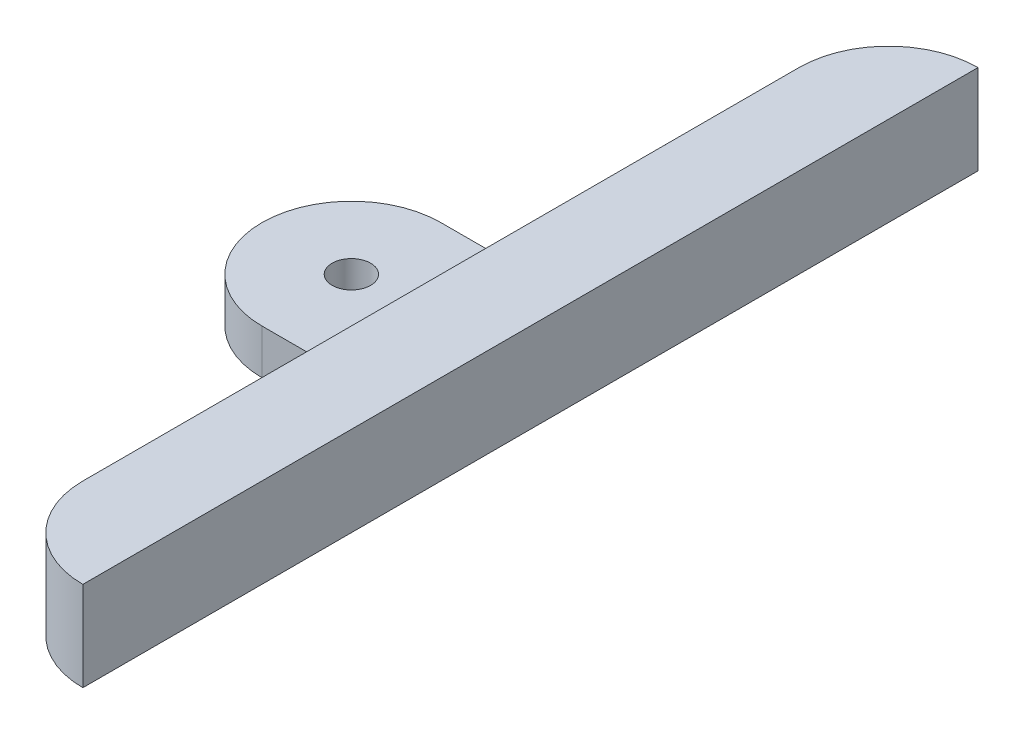
ISO-10303-21;
HEADER;
FILE_DESCRIPTION(('STEP AP214'),'2;1');
FILE_NAME('part.step','',(''),(''),'','','');
FILE_SCHEMA(('AUTOMOTIVE_DESIGN { 1 0 10303 214 1 1 1 1 }'));
ENDSEC;
DATA;
#1=APPLICATION_CONTEXT('core data for automotive mechanical design processes');
#2=APPLICATION_PROTOCOL_DEFINITION('international standard','automotive_design',2000,#1);
#3=PRODUCT_CONTEXT('',#1,'mechanical');
#4=PRODUCT('Part','Part','',(#3));
#5=PRODUCT_RELATED_PRODUCT_CATEGORY('part','',(#4));
#6=PRODUCT_DEFINITION_FORMATION('','',#4);
#7=PRODUCT_DEFINITION_CONTEXT('part definition',#1,'design');
#8=PRODUCT_DEFINITION('design','',#6,#7);
#9=PRODUCT_DEFINITION_SHAPE('','',#8);
#10=(LENGTH_UNIT() NAMED_UNIT(*) SI_UNIT(.MILLI.,.METRE.));
#11=(NAMED_UNIT(*) PLANE_ANGLE_UNIT() SI_UNIT($,.RADIAN.));
#12=(NAMED_UNIT(*) SI_UNIT($,.STERADIAN.) SOLID_ANGLE_UNIT());
#13=UNCERTAINTY_MEASURE_WITH_UNIT(LENGTH_MEASURE(1.E-05),#10,'distance_accuracy_value','');
#14=(GEOMETRIC_REPRESENTATION_CONTEXT(3) GLOBAL_UNCERTAINTY_ASSIGNED_CONTEXT((#13)) GLOBAL_UNIT_ASSIGNED_CONTEXT((#10,
#11,#12)) REPRESENTATION_CONTEXT('',''));
#15=CARTESIAN_POINT('',(0.,0.,0.));
#16=DIRECTION('',(0.,0.,1.));
#17=DIRECTION('',(1.,0.,0.));
#18=AXIS2_PLACEMENT_3D('',#15,#16,#17);
#19=CARTESIAN_POINT('',(-10.,5.,-50.));
#20=DIRECTION('',(1.,0.,0.));
#21=DIRECTION('',(0.,0.,-1.));
#22=AXIS2_PLACEMENT_3D('',#19,#20,#21);
#23=PLANE('',#22);
#24=DIRECTION('',(0.,0.,1.));
#25=VECTOR('',#24,1.);
#26=CARTESIAN_POINT('',(-10.,10.,-50.));
#27=LINE('',#26,#25);
#28=CARTESIAN_POINT('',(-10.,10.,-40.));
#29=VERTEX_POINT('',#28);
#30=CARTESIAN_POINT('',(-10.,10.,40.));
#31=VERTEX_POINT('',#30);
#32=EDGE_CURVE('E145',#29,#31,#27,.T.);
#33=ORIENTED_EDGE('',*,*,#32,.F.);
#34=DIRECTION('',(0.,-1.,0.));
#35=VECTOR('',#34,1.);
#36=CARTESIAN_POINT('',(-10.,5.,-40.));
#37=LINE('',#36,#35);
#38=CARTESIAN_POINT('',(-10.,0.,-40.));
#39=VERTEX_POINT('',#38);
#40=EDGE_CURVE('E176',#29,#39,#37,.T.);
#41=ORIENTED_EDGE('',*,*,#40,.T.);
#42=DIRECTION('',(0.,0.,1.));
#43=VECTOR('',#42,1.);
#44=CARTESIAN_POINT('',(-10.,0.,-50.));
#45=LINE('',#44,#43);
#46=CARTESIAN_POINT('',(-9.99999999999999,0.,-10.));
#47=VERTEX_POINT('',#46);
#48=EDGE_CURVE('E130',#39,#47,#45,.T.);
#49=ORIENTED_EDGE('',*,*,#48,.T.);
#50=DIRECTION('',(0.,-1.,0.));
#51=VECTOR('',#50,1.);
#52=CARTESIAN_POINT('',(-9.99999999999999,0.,-10.));
#53=LINE('',#52,#51);
#54=CARTESIAN_POINT('',(-9.99999999999999,5.,-10.));
#55=VERTEX_POINT('',#54);
#56=EDGE_CURVE('E116',#55,#47,#53,.T.);
#57=ORIENTED_EDGE('',*,*,#56,.F.);
#58=DIRECTION('',(0.,0.,-1.));
#59=VECTOR('',#58,1.);
#60=CARTESIAN_POINT('',(-9.99999999999999,5.,-10.));
#61=LINE('',#60,#59);
#62=CARTESIAN_POINT('',(-9.99999999999999,5.,10.));
#63=VERTEX_POINT('',#62);
#64=EDGE_CURVE('E127',#63,#55,#61,.T.);
#65=ORIENTED_EDGE('',*,*,#64,.F.);
#66=DIRECTION('',(0.,1.,0.));
#67=VECTOR('',#66,1.);
#68=CARTESIAN_POINT('',(-9.99999999999999,5.,10.));
#69=LINE('',#68,#67);
#70=CARTESIAN_POINT('',(-9.99999999999998,0.,10.));
#71=VERTEX_POINT('',#70);
#72=EDGE_CURVE('E136',#71,#63,#69,.T.);
#73=ORIENTED_EDGE('',*,*,#72,.F.);
#74=CARTESIAN_POINT('',(-9.99999999999998,0.,40.));
#75=VERTEX_POINT('',#74);
#76=EDGE_CURVE('E150',#71,#75,#45,.T.);
#77=ORIENTED_EDGE('',*,*,#76,.T.);
#78=DIRECTION('',(0.,-1.,0.));
#79=VECTOR('',#78,1.);
#80=CARTESIAN_POINT('',(-9.99999999999998,5.,40.));
#81=LINE('',#80,#79);
#82=EDGE_CURVE('E62',#75,#31,#81,.F.);
#83=ORIENTED_EDGE('',*,*,#82,.T.);
#84=EDGE_LOOP('',(#33,#41,#49,#57,#65,#73,#77,#83));
#85=FACE_BOUND('',#84,.T.);
#86=ADVANCED_FACE('F39',(#85),#23,.F.);
#87=CARTESIAN_POINT('',(0.,5.,-50.));
#88=DIRECTION('',(-1.,0.,0.));
#89=DIRECTION('',(0.,0.,1.));
#90=AXIS2_PLACEMENT_3D('',#87,#88,#89);
#91=PLANE('',#90);
#92=DIRECTION('',(0.,0.,-1.));
#93=VECTOR('',#92,1.);
#94=CARTESIAN_POINT('',(0.,0.,-50.));
#95=LINE('',#94,#93);
#96=CARTESIAN_POINT('',(0.,0.,50.));
#97=VERTEX_POINT('',#96);
#98=CARTESIAN_POINT('',(0.,0.,-50.));
#99=VERTEX_POINT('',#98);
#100=EDGE_CURVE('E152',#97,#99,#95,.T.);
#101=ORIENTED_EDGE('',*,*,#100,.T.);
#102=DIRECTION('',(0.,-1.,0.));
#103=VECTOR('',#102,1.);
#104=CARTESIAN_POINT('',(0.,5.,-50.));
#105=LINE('',#104,#103);
#106=CARTESIAN_POINT('',(0.,10.,-50.));
#107=VERTEX_POINT('',#106);
#108=EDGE_CURVE('E155',#107,#99,#105,.T.);
#109=ORIENTED_EDGE('',*,*,#108,.F.);
#110=DIRECTION('',(0.,0.,-1.));
#111=VECTOR('',#110,1.);
#112=CARTESIAN_POINT('',(0.,10.,-50.));
#113=LINE('',#112,#111);
#114=CARTESIAN_POINT('',(0.,10.,50.));
#115=VERTEX_POINT('',#114);
#116=EDGE_CURVE('E147',#115,#107,#113,.T.);
#117=ORIENTED_EDGE('',*,*,#116,.F.);
#118=DIRECTION('',(0.,-1.,0.));
#119=VECTOR('',#118,1.);
#120=CARTESIAN_POINT('',(0.,5.,50.));
#121=LINE('',#120,#119);
#122=EDGE_CURVE('E157',#115,#97,#121,.T.);
#123=ORIENTED_EDGE('',*,*,#122,.T.);
#124=EDGE_LOOP('',(#101,#109,#117,#123));
#125=FACE_BOUND('',#124,.T.);
#126=ADVANCED_FACE('F188',(#125),#91,.F.);
#127=CARTESIAN_POINT('',(0.,0.,0.));
#128=DIRECTION('',(0.,1.,0.));
#129=DIRECTION('',(0.,0.,1.));
#130=AXIS2_PLACEMENT_3D('',#127,#128,#129);
#131=PLANE('',#130);
#132=CARTESIAN_POINT('',(-20.,0.,0.));
#133=DIRECTION('',(0.,1.,0.));
#134=DIRECTION('',(0.,0.,1.));
#135=AXIS2_PLACEMENT_3D('',#132,#133,#134);
#136=CIRCLE('',#135,2.15);
#137=CARTESIAN_POINT('',(-20.,0.,2.14999999999999));
#138=VERTEX_POINT('',#137);
#139=EDGE_CURVE('E174',#138,#138,#136,.F.);
#140=ORIENTED_EDGE('',*,*,#139,.F.);
#141=EDGE_LOOP('',(#140));
#142=FACE_BOUND('',#141,.T.);
#143=ORIENTED_EDGE('',*,*,#48,.F.);
#144=CARTESIAN_POINT('',(0.,0.,-40.));
#145=DIRECTION('',(0.,1.,0.));
#146=DIRECTION('',(0.,0.,1.));
#147=AXIS2_PLACEMENT_3D('',#144,#145,#146);
#148=CIRCLE('',#147,10.);
#149=EDGE_CURVE('E54',#39,#99,#148,.F.);
#150=ORIENTED_EDGE('',*,*,#149,.T.);
#151=ORIENTED_EDGE('',*,*,#100,.F.);
#152=CARTESIAN_POINT('',(0.,0.,40.));
#153=DIRECTION('',(0.,1.,0.));
#154=DIRECTION('',(0.,0.,1.));
#155=AXIS2_PLACEMENT_3D('',#152,#153,#154);
#156=CIRCLE('',#155,10.);
#157=EDGE_CURVE('E178',#97,#75,#156,.F.);
#158=ORIENTED_EDGE('',*,*,#157,.T.);
#159=ORIENTED_EDGE('',*,*,#76,.F.);
#160=DIRECTION('',(1.,0.,0.));
#161=VECTOR('',#160,1.);
#162=CARTESIAN_POINT('',(-30.,0.,10.));
#163=LINE('',#162,#161);
#164=CARTESIAN_POINT('',(-20.,0.,10.));
#165=VERTEX_POINT('',#164);
#166=EDGE_CURVE('E132',#165,#71,#163,.T.);
#167=ORIENTED_EDGE('',*,*,#166,.F.);
#168=CARTESIAN_POINT('',(-20.,0.,0.));
#169=DIRECTION('',(0.,1.,0.));
#170=DIRECTION('',(0.,0.,1.));
#171=AXIS2_PLACEMENT_3D('',#168,#169,#170);
#172=CIRCLE('',#171,10.);
#173=CARTESIAN_POINT('',(-30.,0.,0.));
#174=VERTEX_POINT('',#173);
#175=EDGE_CURVE('E169',#165,#174,#172,.F.);
#176=ORIENTED_EDGE('',*,*,#175,.T.);
#177=CARTESIAN_POINT('',(-20.,0.,0.));
#178=DIRECTION('',(0.,1.,0.));
#179=DIRECTION('',(0.,0.,1.));
#180=AXIS2_PLACEMENT_3D('',#177,#178,#179);
#181=CIRCLE('',#180,10.);
#182=CARTESIAN_POINT('',(-20.,0.,-10.));
#183=VERTEX_POINT('',#182);
#184=EDGE_CURVE('E167',#174,#183,#181,.F.);
#185=ORIENTED_EDGE('',*,*,#184,.T.);
#186=DIRECTION('',(1.,0.,0.));
#187=VECTOR('',#186,1.);
#188=CARTESIAN_POINT('',(-30.,0.,-9.99999999999999));
#189=LINE('',#188,#187);
#190=EDGE_CURVE('E123',#183,#47,#189,.T.);
#191=ORIENTED_EDGE('',*,*,#190,.T.);
#192=EDGE_LOOP('',(#143,#150,#151,#158,#159,#167,#176,#185,#191));
#193=FACE_BOUND('',#192,.T.);
#194=ADVANCED_FACE('F192',(#142,#193),#131,.F.);
#195=CARTESIAN_POINT('',(0.,10.,0.));
#196=DIRECTION('',(0.,1.,0.));
#197=DIRECTION('',(0.,0.,1.));
#198=AXIS2_PLACEMENT_3D('',#195,#196,#197);
#199=PLANE('',#198);
#200=ORIENTED_EDGE('',*,*,#116,.T.);
#201=CARTESIAN_POINT('',(0.,10.,-40.));
#202=DIRECTION('',(0.,1.,0.));
#203=DIRECTION('',(0.,0.,1.));
#204=AXIS2_PLACEMENT_3D('',#201,#202,#203);
#205=CIRCLE('',#204,10.);
#206=EDGE_CURVE('E11',#107,#29,#205,.T.);
#207=ORIENTED_EDGE('',*,*,#206,.T.);
#208=ORIENTED_EDGE('',*,*,#32,.T.);
#209=CARTESIAN_POINT('',(0.,10.,40.));
#210=DIRECTION('',(0.,1.,0.));
#211=DIRECTION('',(0.,0.,1.));
#212=AXIS2_PLACEMENT_3D('',#209,#210,#211);
#213=CIRCLE('',#212,10.);
#214=EDGE_CURVE('E47',#31,#115,#213,.T.);
#215=ORIENTED_EDGE('',*,*,#214,.T.);
#216=EDGE_LOOP('',(#200,#207,#208,#215));
#217=FACE_BOUND('',#216,.T.);
#218=ADVANCED_FACE('F183',(#217),#199,.T.);
#219=CARTESIAN_POINT('',(-30.,5.,10.));
#220=DIRECTION('',(0.,0.,-1.));
#221=DIRECTION('',(0.,1.,0.));
#222=AXIS2_PLACEMENT_3D('',#219,#220,#221);
#223=PLANE('',#222);
#224=DIRECTION('',(1.,0.,0.));
#225=VECTOR('',#224,1.);
#226=CARTESIAN_POINT('',(-30.,5.,10.));
#227=LINE('',#226,#225);
#228=CARTESIAN_POINT('',(-20.,5.,10.));
#229=VERTEX_POINT('',#228);
#230=EDGE_CURVE('E122',#229,#63,#227,.T.);
#231=ORIENTED_EDGE('',*,*,#230,.F.);
#232=DIRECTION('',(0.,1.,0.));
#233=VECTOR('',#232,1.);
#234=CARTESIAN_POINT('',(-20.,5.,10.));
#235=LINE('',#234,#233);
#236=EDGE_CURVE('E164',#229,#165,#235,.F.);
#237=ORIENTED_EDGE('',*,*,#236,.T.);
#238=ORIENTED_EDGE('',*,*,#166,.T.);
#239=ORIENTED_EDGE('',*,*,#72,.T.);
#240=EDGE_LOOP('',(#231,#237,#238,#239));
#241=FACE_BOUND('',#240,.T.);
#242=ADVANCED_FACE('F195',(#241),#223,.F.);
#243=CARTESIAN_POINT('',(-30.,5.,-10.));
#244=DIRECTION('',(0.,-1.,0.));
#245=DIRECTION('',(0.,0.,-1.));
#246=AXIS2_PLACEMENT_3D('',#243,#244,#245);
#247=PLANE('',#246);
#248=CARTESIAN_POINT('',(-20.,5.,0.));
#249=DIRECTION('',(0.,1.,0.));
#250=DIRECTION('',(0.,0.,1.));
#251=AXIS2_PLACEMENT_3D('',#248,#249,#250);
#252=CIRCLE('',#251,2.15);
#253=CARTESIAN_POINT('',(-20.,5.,2.14999999999999));
#254=VERTEX_POINT('',#253);
#255=EDGE_CURVE('E362',#254,#254,#252,.T.);
#256=ORIENTED_EDGE('',*,*,#255,.F.);
#257=EDGE_LOOP('',(#256));
#258=FACE_BOUND('',#257,.T.);
#259=CARTESIAN_POINT('',(-20.,5.,0.));
#260=DIRECTION('',(0.,-1.,0.));
#261=DIRECTION('',(0.,0.,-1.));
#262=AXIS2_PLACEMENT_3D('',#259,#260,#261);
#263=CIRCLE('',#262,10.);
#264=CARTESIAN_POINT('',(-20.,5.,-10.));
#265=VERTEX_POINT('',#264);
#266=CARTESIAN_POINT('',(-30.,5.,0.));
#267=VERTEX_POINT('',#266);
#268=EDGE_CURVE('E160',#265,#267,#263,.F.);
#269=ORIENTED_EDGE('',*,*,#268,.T.);
#270=CARTESIAN_POINT('',(-20.,5.,0.));
#271=DIRECTION('',(0.,-1.,0.));
#272=DIRECTION('',(0.,0.,-1.));
#273=AXIS2_PLACEMENT_3D('',#270,#271,#272);
#274=CIRCLE('',#273,10.);
#275=EDGE_CURVE('E162',#267,#229,#274,.F.);
#276=ORIENTED_EDGE('',*,*,#275,.T.);
#277=ORIENTED_EDGE('',*,*,#230,.T.);
#278=ORIENTED_EDGE('',*,*,#64,.T.);
#279=DIRECTION('',(1.,0.,0.));
#280=VECTOR('',#279,1.);
#281=CARTESIAN_POINT('',(-30.,5.,-10.));
#282=LINE('',#281,#280);
#283=EDGE_CURVE('E112',#265,#55,#282,.T.);
#284=ORIENTED_EDGE('',*,*,#283,.F.);
#285=EDGE_LOOP('',(#269,#276,#277,#278,#284));
#286=FACE_BOUND('',#285,.T.);
#287=ADVANCED_FACE('F134',(#258,#286),#247,.F.);
#288=CARTESIAN_POINT('',(-30.,0.,-9.99999999999999));
#289=DIRECTION('',(0.,0.,1.));
#290=DIRECTION('',(0.,-1.,0.));
#291=AXIS2_PLACEMENT_3D('',#288,#289,#290);
#292=PLANE('',#291);
#293=ORIENTED_EDGE('',*,*,#190,.F.);
#294=DIRECTION('',(0.,-1.,0.));
#295=VECTOR('',#294,1.);
#296=CARTESIAN_POINT('',(-20.,0.,-10.));
#297=LINE('',#296,#295);
#298=EDGE_CURVE('E118',#183,#265,#297,.F.);
#299=ORIENTED_EDGE('',*,*,#298,.T.);
#300=ORIENTED_EDGE('',*,*,#283,.T.);
#301=ORIENTED_EDGE('',*,*,#56,.T.);
#302=EDGE_LOOP('',(#293,#299,#300,#301));
#303=FACE_BOUND('',#302,.T.);
#304=ADVANCED_FACE('F115',(#303),#292,.F.);
#305=CARTESIAN_POINT('',(-20.,0.,0.));
#306=DIRECTION('',(0.,-1.,0.));
#307=DIRECTION('',(0.,0.,-1.));
#308=AXIS2_PLACEMENT_3D('',#305,#306,#307);
#309=CYLINDRICAL_SURFACE('',#308,10.);
#310=ORIENTED_EDGE('',*,*,#298,.F.);
#311=ORIENTED_EDGE('',*,*,#184,.F.);
#312=DIRECTION('',(0.,-1.,0.));
#313=VECTOR('',#312,1.);
#314=CARTESIAN_POINT('',(-30.,0.,0.));
#315=LINE('',#314,#313);
#316=EDGE_CURVE('E138',#267,#174,#315,.T.);
#317=ORIENTED_EDGE('',*,*,#316,.F.);
#318=ORIENTED_EDGE('',*,*,#268,.F.);
#319=EDGE_LOOP('',(#310,#311,#317,#318));
#320=FACE_BOUND('',#319,.T.);
#321=ADVANCED_FACE('F201',(#320),#309,.T.);
#322=CARTESIAN_POINT('',(-20.,0.,0.));
#323=DIRECTION('',(0.,1.,0.));
#324=DIRECTION('',(0.,0.,1.));
#325=AXIS2_PLACEMENT_3D('',#322,#323,#324);
#326=CYLINDRICAL_SURFACE('',#325,10.);
#327=ORIENTED_EDGE('',*,*,#175,.F.);
#328=ORIENTED_EDGE('',*,*,#236,.F.);
#329=ORIENTED_EDGE('',*,*,#275,.F.);
#330=ORIENTED_EDGE('',*,*,#316,.T.);
#331=EDGE_LOOP('',(#327,#328,#329,#330));
#332=FACE_BOUND('',#331,.T.);
#333=ADVANCED_FACE('F203',(#332),#326,.T.);
#334=CARTESIAN_POINT('',(-20.,-0.001000000000001,0.));
#335=DIRECTION('',(0.,1.,0.));
#336=DIRECTION('',(0.,0.,1.));
#337=AXIS2_PLACEMENT_3D('',#334,#335,#336);
#338=CYLINDRICAL_SURFACE('',#337,2.15);
#339=ORIENTED_EDGE('',*,*,#255,.T.);
#340=EDGE_LOOP('',(#339));
#341=FACE_BOUND('',#340,.T.);
#342=ORIENTED_EDGE('',*,*,#139,.T.);
#343=EDGE_LOOP('',(#342));
#344=FACE_BOUND('',#343,.T.);
#345=ADVANCED_FACE('F205',(#341,#344),#338,.F.);
#346=CARTESIAN_POINT('',(0.,5.,-40.));
#347=DIRECTION('',(0.,-1.,0.));
#348=DIRECTION('',(0.,0.,-1.));
#349=AXIS2_PLACEMENT_3D('',#346,#347,#348);
#350=CYLINDRICAL_SURFACE('',#349,10.);
#351=ORIENTED_EDGE('',*,*,#206,.F.);
#352=ORIENTED_EDGE('',*,*,#108,.T.);
#353=ORIENTED_EDGE('',*,*,#149,.F.);
#354=ORIENTED_EDGE('',*,*,#40,.F.);
#355=EDGE_LOOP('',(#351,#352,#353,#354));
#356=FACE_BOUND('',#355,.T.);
#357=ADVANCED_FACE('F211',(#356),#350,.T.);
#358=CARTESIAN_POINT('',(0.,5.,40.));
#359=DIRECTION('',(0.,-1.,0.));
#360=DIRECTION('',(0.,0.,-1.));
#361=AXIS2_PLACEMENT_3D('',#358,#359,#360);
#362=CYLINDRICAL_SURFACE('',#361,10.);
#363=ORIENTED_EDGE('',*,*,#214,.F.);
#364=ORIENTED_EDGE('',*,*,#82,.F.);
#365=ORIENTED_EDGE('',*,*,#157,.F.);
#366=ORIENTED_EDGE('',*,*,#122,.F.);
#367=EDGE_LOOP('',(#363,#364,#365,#366));
#368=FACE_BOUND('',#367,.T.);
#369=ADVANCED_FACE('F41',(#368),#362,.T.);
#370=CLOSED_SHELL('',(#86,#126,#194,#218,#242,#287,#304,#321,#333,#345,#357,#369));
#371=MANIFOLD_SOLID_BREP('B2',#370);
#372=ADVANCED_BREP_SHAPE_REPRESENTATION('',(#18,#371),#14);
#373=SHAPE_DEFINITION_REPRESENTATION(#9,#372);
ENDSEC;
END-ISO-10303-21;
